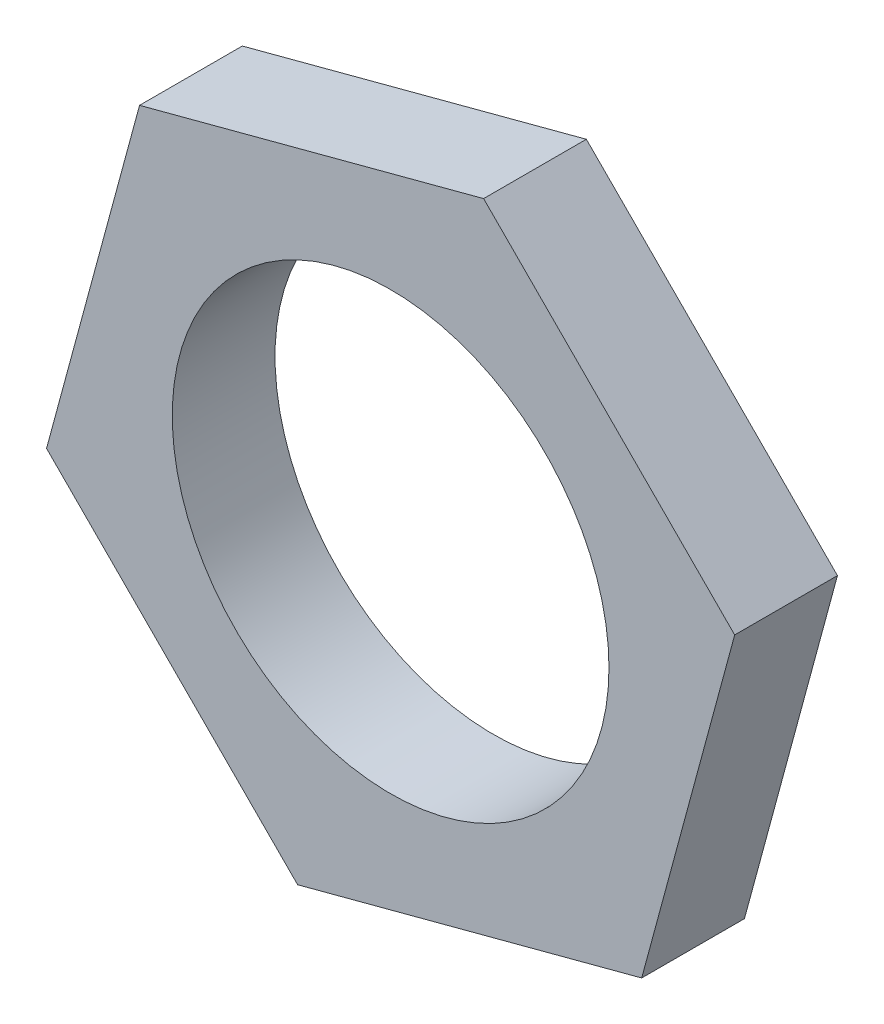
ISO-10303-21;
HEADER;
FILE_DESCRIPTION(('STEP AP214'),'2;1');
FILE_NAME('part.step','',(''),(''),'','','');
FILE_SCHEMA(('AUTOMOTIVE_DESIGN { 1 0 10303 214 1 1 1 1 }'));
ENDSEC;
DATA;
#1=APPLICATION_CONTEXT('core data for automotive mechanical design processes');
#2=APPLICATION_PROTOCOL_DEFINITION('international standard','automotive_design',2000,#1);
#3=PRODUCT_CONTEXT('',#1,'mechanical');
#4=PRODUCT('Part','Part','',(#3));
#5=PRODUCT_RELATED_PRODUCT_CATEGORY('part','',(#4));
#6=PRODUCT_DEFINITION_FORMATION('','',#4);
#7=PRODUCT_DEFINITION_CONTEXT('part definition',#1,'design');
#8=PRODUCT_DEFINITION('design','',#6,#7);
#9=PRODUCT_DEFINITION_SHAPE('','',#8);
#10=(LENGTH_UNIT() NAMED_UNIT(*) SI_UNIT(.MILLI.,.METRE.));
#11=(NAMED_UNIT(*) PLANE_ANGLE_UNIT() SI_UNIT($,.RADIAN.));
#12=(NAMED_UNIT(*) SI_UNIT($,.STERADIAN.) SOLID_ANGLE_UNIT());
#13=UNCERTAINTY_MEASURE_WITH_UNIT(LENGTH_MEASURE(1.E-05),#10,'distance_accuracy_value','');
#14=(GEOMETRIC_REPRESENTATION_CONTEXT(3) GLOBAL_UNCERTAINTY_ASSIGNED_CONTEXT((#13)) GLOBAL_UNIT_ASSIGNED_CONTEXT((#10,
#11,#12)) REPRESENTATION_CONTEXT('',''));
#15=CARTESIAN_POINT('',(0.,0.,0.));
#16=DIRECTION('',(0.,0.,1.));
#17=DIRECTION('',(1.,0.,0.));
#18=AXIS2_PLACEMENT_3D('',#15,#16,#17);
#19=CARTESIAN_POINT('',(0.,0.,2.));
#20=DIRECTION('',(0.,0.,1.));
#21=DIRECTION('',(1.,0.,0.));
#22=AXIS2_PLACEMENT_3D('',#19,#20,#21);
#23=PLANE('',#22);
#24=DIRECTION('',(0.966571459884489,0.256397373108165,0.));
#25=VECTOR('',#24,1.);
#26=CARTESIAN_POINT('',(-1.80991751668293,-6.68761531360801,2.));
#27=LINE('',#26,#25);
#28=CARTESIAN_POINT('',(-1.80991751668293,-6.68761531360801,2.));
#29=VERTEX_POINT('',#28);
#30=CARTESIAN_POINT('',(4.88668599398091,-4.91124220500586,2.));
#31=VERTEX_POINT('',#30);
#32=EDGE_CURVE('E135',#29,#31,#27,.T.);
#33=ORIENTED_EDGE('',*,*,#32,.T.);
#34=DIRECTION('',(0.261239091366977,0.965274125387061,0.));
#35=VECTOR('',#34,1.);
#36=CARTESIAN_POINT('',(4.88668599398091,-4.91124220500586,2.));
#37=LINE('',#36,#35);
#38=CARTESIAN_POINT('',(6.69660351066383,1.77637310860214,2.));
#39=VERTEX_POINT('',#38);
#40=EDGE_CURVE('E93',#31,#39,#37,.T.);
#41=ORIENTED_EDGE('',*,*,#40,.T.);
#42=DIRECTION('',(-0.705332368517512,0.708876752278897,0.));
#43=VECTOR('',#42,1.);
#44=CARTESIAN_POINT('',(6.69660351066383,1.77637310860214,2.));
#45=LINE('',#44,#43);
#46=CARTESIAN_POINT('',(1.80991751668293,6.68761531360801,2.));
#47=VERTEX_POINT('',#46);
#48=EDGE_CURVE('E106',#39,#47,#45,.T.);
#49=ORIENTED_EDGE('',*,*,#48,.T.);
#50=DIRECTION('',(-0.966571459884489,-0.256397373108165,0.));
#51=VECTOR('',#50,1.);
#52=CARTESIAN_POINT('',(1.80991751668293,6.68761531360801,2.));
#53=LINE('',#52,#51);
#54=CARTESIAN_POINT('',(-4.88668599398091,4.91124220500586,2.));
#55=VERTEX_POINT('',#54);
#56=EDGE_CURVE('E100',#47,#55,#53,.T.);
#57=ORIENTED_EDGE('',*,*,#56,.T.);
#58=DIRECTION('',(-0.261239091366977,-0.965274125387061,0.));
#59=VECTOR('',#58,1.);
#60=CARTESIAN_POINT('',(-4.88668599398091,4.91124220500586,2.));
#61=LINE('',#60,#59);
#62=CARTESIAN_POINT('',(-6.69660351066383,-1.77637310860214,2.));
#63=VERTEX_POINT('',#62);
#64=EDGE_CURVE('E104',#55,#63,#61,.T.);
#65=ORIENTED_EDGE('',*,*,#64,.T.);
#66=DIRECTION('',(0.705332368517512,-0.708876752278897,0.));
#67=VECTOR('',#66,1.);
#68=CARTESIAN_POINT('',(-6.69660351066383,-1.77637310860214,2.));
#69=LINE('',#68,#67);
#70=EDGE_CURVE('E56',#63,#29,#69,.T.);
#71=ORIENTED_EDGE('',*,*,#70,.T.);
#72=EDGE_LOOP('',(#33,#41,#49,#57,#65,#71));
#73=FACE_BOUND('',#72,.T.);
#74=CARTESIAN_POINT('',(0.,0.,2.));
#75=DIRECTION('',(0.,0.,1.));
#76=DIRECTION('',(1.,0.,0.));
#77=AXIS2_PLACEMENT_3D('',#74,#75,#76);
#78=CIRCLE('',#77,4.25);
#79=CARTESIAN_POINT('',(4.25,0.,2.));
#80=VERTEX_POINT('',#79);
#81=EDGE_CURVE('E128',#80,#80,#78,.T.);
#82=ORIENTED_EDGE('',*,*,#81,.F.);
#83=EDGE_LOOP('',(#82));
#84=FACE_BOUND('',#83,.T.);
#85=ADVANCED_FACE('F39',(#73,#84),#23,.T.);
#86=CARTESIAN_POINT('',(0.,0.,0.));
#87=DIRECTION('',(0.,0.,1.));
#88=DIRECTION('',(1.,0.,0.));
#89=AXIS2_PLACEMENT_3D('',#86,#87,#88);
#90=PLANE('',#89);
#91=DIRECTION('',(0.966571459884489,0.256397373108165,0.));
#92=VECTOR('',#91,1.);
#93=CARTESIAN_POINT('',(-1.80991751668293,-6.68761531360801,0.));
#94=LINE('',#93,#92);
#95=CARTESIAN_POINT('',(-1.80991751668293,-6.68761531360801,0.));
#96=VERTEX_POINT('',#95);
#97=CARTESIAN_POINT('',(4.88668599398091,-4.91124220500586,0.));
#98=VERTEX_POINT('',#97);
#99=EDGE_CURVE('E124',#96,#98,#94,.T.);
#100=ORIENTED_EDGE('',*,*,#99,.F.);
#101=DIRECTION('',(0.705332368517512,-0.708876752278897,0.));
#102=VECTOR('',#101,1.);
#103=CARTESIAN_POINT('',(-6.69660351066383,-1.77637310860214,0.));
#104=LINE('',#103,#102);
#105=CARTESIAN_POINT('',(-6.69660351066383,-1.77637310860214,0.));
#106=VERTEX_POINT('',#105);
#107=EDGE_CURVE('E85',#106,#96,#104,.T.);
#108=ORIENTED_EDGE('',*,*,#107,.F.);
#109=DIRECTION('',(-0.261239091366977,-0.965274125387061,0.));
#110=VECTOR('',#109,1.);
#111=CARTESIAN_POINT('',(-4.88668599398091,4.91124220500586,0.));
#112=LINE('',#111,#110);
#113=CARTESIAN_POINT('',(-4.88668599398091,4.91124220500586,0.));
#114=VERTEX_POINT('',#113);
#115=EDGE_CURVE('E79',#114,#106,#112,.T.);
#116=ORIENTED_EDGE('',*,*,#115,.F.);
#117=DIRECTION('',(-0.966571459884489,-0.256397373108165,0.));
#118=VECTOR('',#117,1.);
#119=CARTESIAN_POINT('',(1.80991751668293,6.68761531360801,0.));
#120=LINE('',#119,#118);
#121=CARTESIAN_POINT('',(1.80991751668293,6.68761531360801,0.));
#122=VERTEX_POINT('',#121);
#123=EDGE_CURVE('E114',#122,#114,#120,.T.);
#124=ORIENTED_EDGE('',*,*,#123,.F.);
#125=DIRECTION('',(-0.705332368517512,0.708876752278897,0.));
#126=VECTOR('',#125,1.);
#127=CARTESIAN_POINT('',(6.69660351066383,1.77637310860214,0.));
#128=LINE('',#127,#126);
#129=CARTESIAN_POINT('',(6.69660351066383,1.77637310860214,0.));
#130=VERTEX_POINT('',#129);
#131=EDGE_CURVE('E130',#130,#122,#128,.T.);
#132=ORIENTED_EDGE('',*,*,#131,.F.);
#133=DIRECTION('',(0.261239091366977,0.965274125387061,0.));
#134=VECTOR('',#133,1.);
#135=CARTESIAN_POINT('',(4.88668599398091,-4.91124220500586,0.));
#136=LINE('',#135,#134);
#137=EDGE_CURVE('E127',#98,#130,#136,.T.);
#138=ORIENTED_EDGE('',*,*,#137,.F.);
#139=EDGE_LOOP('',(#100,#108,#116,#124,#132,#138));
#140=FACE_BOUND('',#139,.T.);
#141=CARTESIAN_POINT('',(0.,0.,0.));
#142=DIRECTION('',(0.,0.,1.));
#143=DIRECTION('',(1.,0.,0.));
#144=AXIS2_PLACEMENT_3D('',#141,#142,#143);
#145=CIRCLE('',#144,4.25);
#146=CARTESIAN_POINT('',(4.25,0.,0.));
#147=VERTEX_POINT('',#146);
#148=EDGE_CURVE('E228',#147,#147,#145,.T.);
#149=ORIENTED_EDGE('',*,*,#148,.T.);
#150=EDGE_LOOP('',(#149));
#151=FACE_BOUND('',#150,.T.);
#152=ADVANCED_FACE('F144',(#140,#151),#90,.F.);
#153=CARTESIAN_POINT('',(-1.80991751668293,-6.68761531360801,2.));
#154=DIRECTION('',(-0.256397373108165,0.966571459884489,0.));
#155=DIRECTION('',(-0.966571459884489,-0.256397373108165,0.));
#156=AXIS2_PLACEMENT_3D('',#153,#154,#155);
#157=PLANE('',#156);
#158=ORIENTED_EDGE('',*,*,#99,.T.);
#159=DIRECTION('',(0.,0.,-1.));
#160=VECTOR('',#159,1.);
#161=CARTESIAN_POINT('',(4.88668599398091,-4.91124220500586,2.));
#162=LINE('',#161,#160);
#163=EDGE_CURVE('E11',#31,#98,#162,.T.);
#164=ORIENTED_EDGE('',*,*,#163,.F.);
#165=ORIENTED_EDGE('',*,*,#32,.F.);
#166=DIRECTION('',(0.,0.,-1.));
#167=VECTOR('',#166,1.);
#168=CARTESIAN_POINT('',(-1.80991751668293,-6.68761531360801,2.));
#169=LINE('',#168,#167);
#170=EDGE_CURVE('E120',#29,#96,#169,.T.);
#171=ORIENTED_EDGE('',*,*,#170,.T.);
#172=EDGE_LOOP('',(#158,#164,#165,#171));
#173=FACE_BOUND('',#172,.T.);
#174=ADVANCED_FACE('F41',(#173),#157,.F.);
#175=CARTESIAN_POINT('',(4.88668599398091,-4.91124220500586,2.));
#176=DIRECTION('',(-0.965274125387061,0.261239091366977,0.));
#177=DIRECTION('',(-0.261239091366977,-0.965274125387061,0.));
#178=AXIS2_PLACEMENT_3D('',#175,#176,#177);
#179=PLANE('',#178);
#180=ORIENTED_EDGE('',*,*,#137,.T.);
#181=DIRECTION('',(0.,0.,-1.));
#182=VECTOR('',#181,1.);
#183=CARTESIAN_POINT('',(6.69660351066383,1.77637310860214,2.));
#184=LINE('',#183,#182);
#185=EDGE_CURVE('E48',#39,#130,#184,.T.);
#186=ORIENTED_EDGE('',*,*,#185,.F.);
#187=ORIENTED_EDGE('',*,*,#40,.F.);
#188=ORIENTED_EDGE('',*,*,#163,.T.);
#189=EDGE_LOOP('',(#180,#186,#187,#188));
#190=FACE_BOUND('',#189,.T.);
#191=ADVANCED_FACE('F169',(#190),#179,.F.);
#192=CARTESIAN_POINT('',(6.69660351066383,1.77637310860214,2.));
#193=DIRECTION('',(-0.708876752278897,-0.705332368517512,0.));
#194=DIRECTION('',(0.705332368517512,-0.708876752278897,0.));
#195=AXIS2_PLACEMENT_3D('',#192,#193,#194);
#196=PLANE('',#195);
#197=ORIENTED_EDGE('',*,*,#131,.T.);
#198=DIRECTION('',(0.,0.,-1.));
#199=VECTOR('',#198,1.);
#200=CARTESIAN_POINT('',(1.80991751668293,6.68761531360801,2.));
#201=LINE('',#200,#199);
#202=EDGE_CURVE('E115',#47,#122,#201,.T.);
#203=ORIENTED_EDGE('',*,*,#202,.F.);
#204=ORIENTED_EDGE('',*,*,#48,.F.);
#205=ORIENTED_EDGE('',*,*,#185,.T.);
#206=EDGE_LOOP('',(#197,#203,#204,#205));
#207=FACE_BOUND('',#206,.T.);
#208=ADVANCED_FACE('F141',(#207),#196,.F.);
#209=CARTESIAN_POINT('',(1.80991751668293,6.68761531360801,2.));
#210=DIRECTION('',(0.256397373108165,-0.966571459884489,0.));
#211=DIRECTION('',(0.966571459884489,0.256397373108165,0.));
#212=AXIS2_PLACEMENT_3D('',#209,#210,#211);
#213=PLANE('',#212);
#214=ORIENTED_EDGE('',*,*,#123,.T.);
#215=DIRECTION('',(0.,0.,-1.));
#216=VECTOR('',#215,1.);
#217=CARTESIAN_POINT('',(-4.88668599398091,4.91124220500586,2.));
#218=LINE('',#217,#216);
#219=EDGE_CURVE('E111',#55,#114,#218,.T.);
#220=ORIENTED_EDGE('',*,*,#219,.F.);
#221=ORIENTED_EDGE('',*,*,#56,.F.);
#222=ORIENTED_EDGE('',*,*,#202,.T.);
#223=EDGE_LOOP('',(#214,#220,#221,#222));
#224=FACE_BOUND('',#223,.T.);
#225=ADVANCED_FACE('F112',(#224),#213,.F.);
#226=CARTESIAN_POINT('',(-4.88668599398091,4.91124220500586,2.));
#227=DIRECTION('',(0.965274125387061,-0.261239091366977,0.));
#228=DIRECTION('',(0.261239091366977,0.965274125387061,0.));
#229=AXIS2_PLACEMENT_3D('',#226,#227,#228);
#230=PLANE('',#229);
#231=ORIENTED_EDGE('',*,*,#115,.T.);
#232=DIRECTION('',(0.,0.,-1.));
#233=VECTOR('',#232,1.);
#234=CARTESIAN_POINT('',(-6.69660351066383,-1.77637310860214,2.));
#235=LINE('',#234,#233);
#236=EDGE_CURVE('E116',#63,#106,#235,.T.);
#237=ORIENTED_EDGE('',*,*,#236,.F.);
#238=ORIENTED_EDGE('',*,*,#64,.F.);
#239=ORIENTED_EDGE('',*,*,#219,.T.);
#240=EDGE_LOOP('',(#231,#237,#238,#239));
#241=FACE_BOUND('',#240,.T.);
#242=ADVANCED_FACE('F118',(#241),#230,.F.);
#243=CARTESIAN_POINT('',(-6.69660351066383,-1.77637310860214,2.));
#244=DIRECTION('',(0.708876752278897,0.705332368517512,0.));
#245=DIRECTION('',(-0.705332368517512,0.708876752278897,0.));
#246=AXIS2_PLACEMENT_3D('',#243,#244,#245);
#247=PLANE('',#246);
#248=ORIENTED_EDGE('',*,*,#107,.T.);
#249=ORIENTED_EDGE('',*,*,#170,.F.);
#250=ORIENTED_EDGE('',*,*,#70,.F.);
#251=ORIENTED_EDGE('',*,*,#236,.T.);
#252=EDGE_LOOP('',(#248,#249,#250,#251));
#253=FACE_BOUND('',#252,.T.);
#254=ADVANCED_FACE('F149',(#253),#247,.F.);
#255=CARTESIAN_POINT('',(0.,0.,2.));
#256=DIRECTION('',(0.,0.,-1.));
#257=DIRECTION('',(-1.,0.,0.));
#258=AXIS2_PLACEMENT_3D('',#255,#256,#257);
#259=CYLINDRICAL_SURFACE('',#258,4.25);
#260=ORIENTED_EDGE('',*,*,#81,.T.);
#261=EDGE_LOOP('',(#260));
#262=FACE_BOUND('',#261,.T.);
#263=ORIENTED_EDGE('',*,*,#148,.F.);
#264=EDGE_LOOP('',(#263));
#265=FACE_BOUND('',#264,.T.);
#266=ADVANCED_FACE('F151',(#262,#265),#259,.F.);
#267=CLOSED_SHELL('',(#85,#152,#174,#191,#208,#225,#242,#254,#266));
#268=MANIFOLD_SOLID_BREP('B2',#267);
#269=ADVANCED_BREP_SHAPE_REPRESENTATION('',(#18,#268),#14);
#270=SHAPE_DEFINITION_REPRESENTATION(#9,#269);
ENDSEC;
END-ISO-10303-21;
